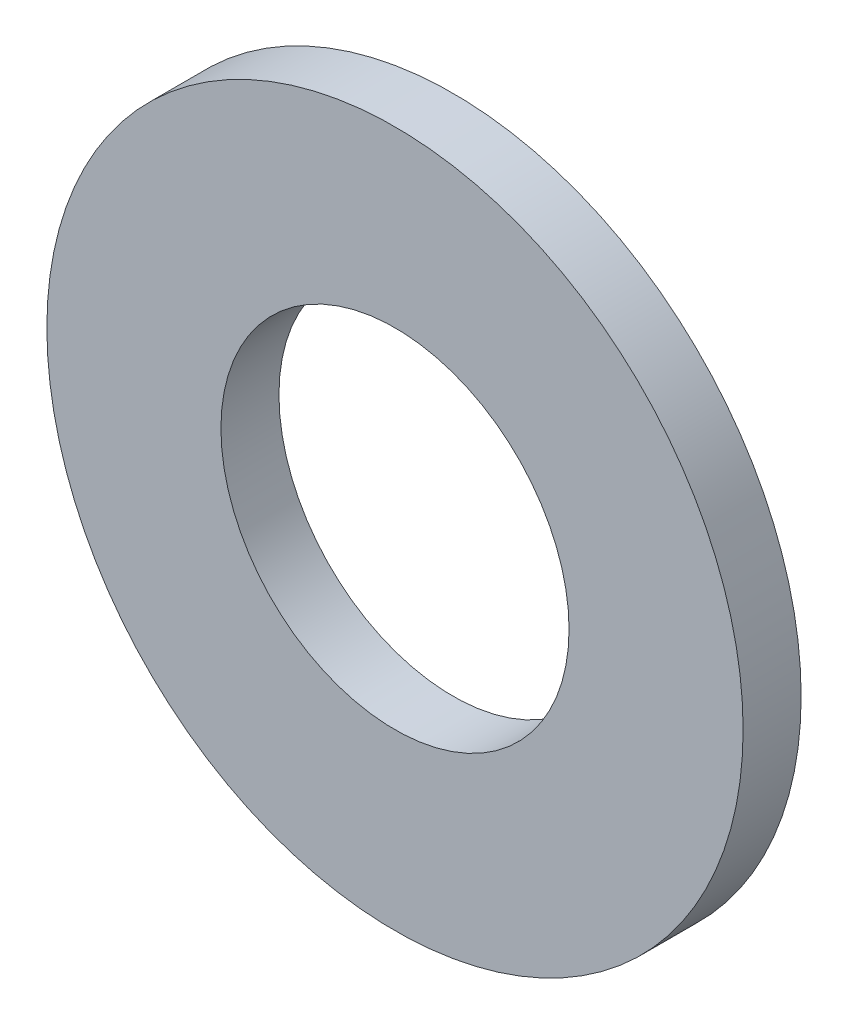
ISO-10303-21;
HEADER;
FILE_DESCRIPTION(('STEP AP214'),'2;1');
FILE_NAME('part.step','',(''),(''),'','','');
FILE_SCHEMA(('AUTOMOTIVE_DESIGN { 1 0 10303 214 1 1 1 1 }'));
ENDSEC;
DATA;
#1=APPLICATION_CONTEXT('core data for automotive mechanical design processes');
#2=APPLICATION_PROTOCOL_DEFINITION('international standard','automotive_design',2000,#1);
#3=PRODUCT_CONTEXT('',#1,'mechanical');
#4=PRODUCT('Part','Part','',(#3));
#5=PRODUCT_RELATED_PRODUCT_CATEGORY('part','',(#4));
#6=PRODUCT_DEFINITION_FORMATION('','',#4);
#7=PRODUCT_DEFINITION_CONTEXT('part definition',#1,'design');
#8=PRODUCT_DEFINITION('design','',#6,#7);
#9=PRODUCT_DEFINITION_SHAPE('','',#8);
#10=(LENGTH_UNIT() NAMED_UNIT(*) SI_UNIT(.MILLI.,.METRE.));
#11=(NAMED_UNIT(*) PLANE_ANGLE_UNIT() SI_UNIT($,.RADIAN.));
#12=(NAMED_UNIT(*) SI_UNIT($,.STERADIAN.) SOLID_ANGLE_UNIT());
#13=UNCERTAINTY_MEASURE_WITH_UNIT(LENGTH_MEASURE(1.E-05),#10,'distance_accuracy_value','');
#14=(GEOMETRIC_REPRESENTATION_CONTEXT(3) GLOBAL_UNCERTAINTY_ASSIGNED_CONTEXT((#13)) GLOBAL_UNIT_ASSIGNED_CONTEXT((#10,
#11,#12)) REPRESENTATION_CONTEXT('',''));
#15=CARTESIAN_POINT('',(0.,0.,0.));
#16=DIRECTION('',(0.,0.,1.));
#17=DIRECTION('',(1.,0.,0.));
#18=AXIS2_PLACEMENT_3D('',#15,#16,#17);
#19=CARTESIAN_POINT('',(0.,0.,1.5875));
#20=DIRECTION('',(0.,0.,1.));
#21=DIRECTION('',(1.,0.,0.));
#22=AXIS2_PLACEMENT_3D('',#19,#20,#21);
#23=PLANE('',#22);
#24=CARTESIAN_POINT('',(0.,0.,1.5875));
#25=DIRECTION('',(0.,0.,1.));
#26=DIRECTION('',(1.,0.,0.));
#27=AXIS2_PLACEMENT_3D('',#24,#25,#26);
#28=CIRCLE('',#27,9.525);
#29=CARTESIAN_POINT('',(9.525,0.,1.5875));
#30=VERTEX_POINT('',#29);
#31=EDGE_CURVE('E10',#30,#30,#28,.T.);
#32=ORIENTED_EDGE('',*,*,#31,.T.);
#33=EDGE_LOOP('',(#32));
#34=FACE_BOUND('',#33,.T.);
#35=CARTESIAN_POINT('',(0.,0.,1.5875));
#36=DIRECTION('',(0.,0.,1.));
#37=DIRECTION('',(1.,0.,0.));
#38=AXIS2_PLACEMENT_3D('',#35,#36,#37);
#39=CIRCLE('',#38,4.7625);
#40=CARTESIAN_POINT('',(4.7625,0.,1.5875));
#41=VERTEX_POINT('',#40);
#42=EDGE_CURVE('E42',#41,#41,#39,.T.);
#43=ORIENTED_EDGE('',*,*,#42,.F.);
#44=EDGE_LOOP('',(#43));
#45=FACE_BOUND('',#44,.T.);
#46=ADVANCED_FACE('F31',(#34,#45),#23,.T.);
#47=CARTESIAN_POINT('',(0.,0.,0.));
#48=DIRECTION('',(0.,0.,1.));
#49=DIRECTION('',(1.,0.,0.));
#50=AXIS2_PLACEMENT_3D('',#47,#48,#49);
#51=PLANE('',#50);
#52=CARTESIAN_POINT('',(0.,0.,0.));
#53=DIRECTION('',(0.,0.,1.));
#54=DIRECTION('',(1.,0.,0.));
#55=AXIS2_PLACEMENT_3D('',#52,#53,#54);
#56=CIRCLE('',#55,9.525);
#57=CARTESIAN_POINT('',(9.525,0.,0.));
#58=VERTEX_POINT('',#57);
#59=EDGE_CURVE('E35',#58,#58,#56,.T.);
#60=ORIENTED_EDGE('',*,*,#59,.F.);
#61=EDGE_LOOP('',(#60));
#62=FACE_BOUND('',#61,.T.);
#63=CARTESIAN_POINT('',(0.,0.,0.));
#64=DIRECTION('',(0.,0.,1.));
#65=DIRECTION('',(1.,0.,0.));
#66=AXIS2_PLACEMENT_3D('',#63,#64,#65);
#67=CIRCLE('',#66,4.7625);
#68=CARTESIAN_POINT('',(4.7625,0.,0.));
#69=VERTEX_POINT('',#68);
#70=EDGE_CURVE('E44',#69,#69,#67,.T.);
#71=ORIENTED_EDGE('',*,*,#70,.T.);
#72=EDGE_LOOP('',(#71));
#73=FACE_BOUND('',#72,.T.);
#74=ADVANCED_FACE('F54',(#62,#73),#51,.F.);
#75=CARTESIAN_POINT('',(0.,0.,1.5875));
#76=DIRECTION('',(0.,0.,-1.));
#77=DIRECTION('',(-1.,0.,0.));
#78=AXIS2_PLACEMENT_3D('',#75,#76,#77);
#79=CYLINDRICAL_SURFACE('',#78,9.525);
#80=ORIENTED_EDGE('',*,*,#31,.F.);
#81=EDGE_LOOP('',(#80));
#82=FACE_BOUND('',#81,.T.);
#83=ORIENTED_EDGE('',*,*,#59,.T.);
#84=EDGE_LOOP('',(#83));
#85=FACE_BOUND('',#84,.T.);
#86=ADVANCED_FACE('F33',(#82,#85),#79,.T.);
#87=CARTESIAN_POINT('',(0.,0.,1.5875));
#88=DIRECTION('',(0.,0.,-1.));
#89=DIRECTION('',(-1.,0.,0.));
#90=AXIS2_PLACEMENT_3D('',#87,#88,#89);
#91=CYLINDRICAL_SURFACE('',#90,4.7625);
#92=ORIENTED_EDGE('',*,*,#42,.T.);
#93=EDGE_LOOP('',(#92));
#94=FACE_BOUND('',#93,.T.);
#95=ORIENTED_EDGE('',*,*,#70,.F.);
#96=EDGE_LOOP('',(#95));
#97=FACE_BOUND('',#96,.T.);
#98=ADVANCED_FACE('F50',(#94,#97),#91,.F.);
#99=CLOSED_SHELL('',(#46,#74,#86,#98));
#100=MANIFOLD_SOLID_BREP('B2',#99);
#101=ADVANCED_BREP_SHAPE_REPRESENTATION('',(#18,#100),#14);
#102=SHAPE_DEFINITION_REPRESENTATION(#9,#101);
ENDSEC;
END-ISO-10303-21;
